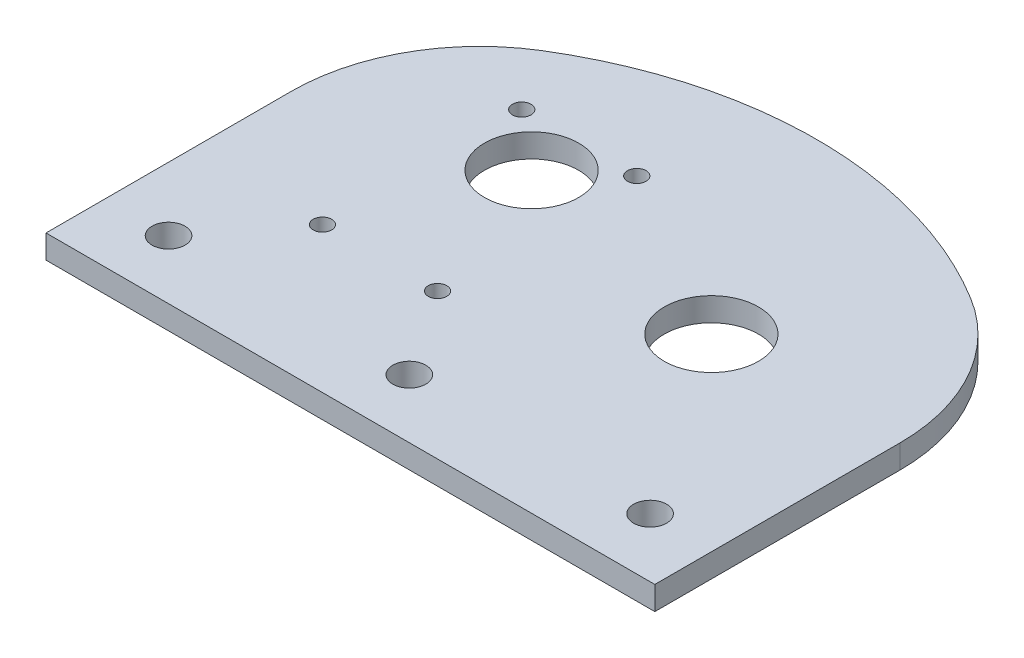
ISO-10303-21;
HEADER;
FILE_DESCRIPTION(('STEP AP214'),'2;1');
FILE_NAME('part.step','',(''),(''),'','','');
FILE_SCHEMA(('AUTOMOTIVE_DESIGN { 1 0 10303 214 1 1 1 1 }'));
ENDSEC;
DATA;
#1=APPLICATION_CONTEXT('core data for automotive mechanical design processes');
#2=APPLICATION_PROTOCOL_DEFINITION('international standard','automotive_design',2000,#1);
#3=PRODUCT_CONTEXT('',#1,'mechanical');
#4=PRODUCT('Part','Part','',(#3));
#5=PRODUCT_RELATED_PRODUCT_CATEGORY('part','',(#4));
#6=PRODUCT_DEFINITION_FORMATION('','',#4);
#7=PRODUCT_DEFINITION_CONTEXT('part definition',#1,'design');
#8=PRODUCT_DEFINITION('design','',#6,#7);
#9=PRODUCT_DEFINITION_SHAPE('','',#8);
#10=(LENGTH_UNIT() NAMED_UNIT(*) SI_UNIT(.MILLI.,.METRE.));
#11=(NAMED_UNIT(*) PLANE_ANGLE_UNIT() SI_UNIT($,.RADIAN.));
#12=(NAMED_UNIT(*) SI_UNIT($,.STERADIAN.) SOLID_ANGLE_UNIT());
#13=UNCERTAINTY_MEASURE_WITH_UNIT(LENGTH_MEASURE(1.E-05),#10,'distance_accuracy_value','');
#14=(GEOMETRIC_REPRESENTATION_CONTEXT(3) GLOBAL_UNCERTAINTY_ASSIGNED_CONTEXT((#13)) GLOBAL_UNIT_ASSIGNED_CONTEXT((#10,
#11,#12)) REPRESENTATION_CONTEXT('',''));
#15=CARTESIAN_POINT('',(0.,0.,0.));
#16=DIRECTION('',(0.,0.,1.));
#17=DIRECTION('',(1.,0.,0.));
#18=AXIS2_PLACEMENT_3D('',#15,#16,#17);
#19=CARTESIAN_POINT('',(0.,1.5875,0.));
#20=DIRECTION('',(0.,1.,0.));
#21=DIRECTION('',(0.,0.,1.));
#22=AXIS2_PLACEMENT_3D('',#19,#20,#21);
#23=PLANE('',#22);
#24=CARTESIAN_POINT('',(48.0524899919907,1.58750000000001,25.0825));
#25=DIRECTION('',(0.,-1.,0.));
#26=DIRECTION('',(0.,0.,-1.));
#27=AXIS2_PLACEMENT_3D('',#24,#25,#26);
#28=CIRCLE('',#27,2.2225);
#29=CARTESIAN_POINT('',(48.0524899919907,1.58750000000001,22.8599999999999));
#30=VERTEX_POINT('',#29);
#31=EDGE_CURVE('E265',#30,#30,#28,.T.);
#32=ORIENTED_EDGE('',*,*,#31,.T.);
#33=EDGE_LOOP('',(#32));
#34=FACE_BOUND('',#33,.T.);
#35=CARTESIAN_POINT('',(-16.8275,1.58750000000001,25.0825));
#36=DIRECTION('',(0.,-1.,0.));
#37=DIRECTION('',(0.,0.,-1.));
#38=AXIS2_PLACEMENT_3D('',#35,#36,#37);
#39=CIRCLE('',#38,2.2225);
#40=CARTESIAN_POINT('',(-16.8275,1.58750000000001,22.86));
#41=VERTEX_POINT('',#40);
#42=EDGE_CURVE('E268',#41,#41,#39,.T.);
#43=ORIENTED_EDGE('',*,*,#42,.T.);
#44=EDGE_LOOP('',(#43));
#45=FACE_BOUND('',#44,.T.);
#46=CARTESIAN_POINT('',(15.6124949959954,1.58750000000001,25.0825));
#47=DIRECTION('',(0.,-1.,0.));
#48=DIRECTION('',(0.,0.,-1.));
#49=AXIS2_PLACEMENT_3D('',#46,#47,#48);
#50=CIRCLE('',#49,2.2225);
#51=CARTESIAN_POINT('',(15.6124949959954,1.58750000000001,22.86));
#52=VERTEX_POINT('',#51);
#53=EDGE_CURVE('E109',#52,#52,#50,.T.);
#54=ORIENTED_EDGE('',*,*,#53,.T.);
#55=EDGE_LOOP('',(#54));
#56=FACE_BOUND('',#55,.T.);
#57=CARTESIAN_POINT('',(31.2249899919907,1.5875,0.));
#58=DIRECTION('',(0.,1.,0.));
#59=DIRECTION('',(0.,0.,1.));
#60=AXIS2_PLACEMENT_3D('',#57,#58,#59);
#61=CIRCLE('',#60,6.35000000002379);
#62=CARTESIAN_POINT('',(31.2249899919907,1.5875,6.35000000002379));
#63=VERTEX_POINT('',#62);
#64=EDGE_CURVE('E118',#63,#63,#61,.T.);
#65=ORIENTED_EDGE('',*,*,#64,.F.);
#66=EDGE_LOOP('',(#65));
#67=FACE_BOUND('',#66,.T.);
#68=CARTESIAN_POINT('',(15.612494995996,1.5875,25.4));
#69=DIRECTION('',(0.,1.,0.));
#70=DIRECTION('',(0.,0.,-1.));
#71=AXIS2_PLACEMENT_3D('',#68,#69,#70);
#72=CIRCLE('',#71,55.2145937419912);
#73=CARTESIAN_POINT('',(44.5257706878475,1.5875,-21.6390672830587));
#74=VERTEX_POINT('',#73);
#75=CARTESIAN_POINT('',(-13.3007806958569,1.5875,-21.6390672830582));
#76=VERTEX_POINT('',#75);
#77=EDGE_CURVE('E135',#74,#76,#72,.T.);
#78=ORIENTED_EDGE('',*,*,#77,.T.);
#79=CARTESIAN_POINT('',(0.,1.5875,0.));
#80=DIRECTION('',(0.,1.,0.));
#81=DIRECTION('',(0.,0.,1.));
#82=AXIS2_PLACEMENT_3D('',#79,#80,#81);
#83=CIRCLE('',#82,25.4);
#84=CARTESIAN_POINT('',(-25.4,1.5875,0.));
#85=VERTEX_POINT('',#84);
#86=EDGE_CURVE('E48',#76,#85,#83,.T.);
#87=ORIENTED_EDGE('',*,*,#86,.T.);
#88=DIRECTION('',(0.,0.,1.));
#89=VECTOR('',#88,1.);
#90=CARTESIAN_POINT('',(-25.4,1.5875,0.));
#91=LINE('',#90,#89);
#92=CARTESIAN_POINT('',(-25.4,1.58750000000001,33.02));
#93=VERTEX_POINT('',#92);
#94=EDGE_CURVE('E41',#85,#93,#91,.T.);
#95=ORIENTED_EDGE('',*,*,#94,.T.);
#96=DIRECTION('',(-1.,0.,0.));
#97=VECTOR('',#96,1.);
#98=CARTESIAN_POINT('',(56.6249899919907,1.5875,33.02));
#99=LINE('',#98,#97);
#100=CARTESIAN_POINT('',(56.6249899919907,1.5875,33.02));
#101=VERTEX_POINT('',#100);
#102=EDGE_CURVE('E108',#101,#93,#99,.T.);
#103=ORIENTED_EDGE('',*,*,#102,.F.);
#104=DIRECTION('',(0.,0.,-1.));
#105=VECTOR('',#104,1.);
#106=CARTESIAN_POINT('',(56.6249899919907,1.5875,25.4));
#107=LINE('',#106,#105);
#108=CARTESIAN_POINT('',(56.6249899919907,1.5875,0.));
#109=VERTEX_POINT('',#108);
#110=EDGE_CURVE('E131',#101,#109,#107,.T.);
#111=ORIENTED_EDGE('',*,*,#110,.T.);
#112=CARTESIAN_POINT('',(31.2249899919907,1.5875,0.));
#113=DIRECTION('',(0.,1.,0.));
#114=DIRECTION('',(0.,0.,1.));
#115=AXIS2_PLACEMENT_3D('',#112,#113,#114);
#116=CIRCLE('',#115,25.4);
#117=EDGE_CURVE('E133',#109,#74,#116,.T.);
#118=ORIENTED_EDGE('',*,*,#117,.T.);
#119=EDGE_LOOP('',(#78,#87,#95,#103,#111,#118));
#120=FACE_BOUND('',#119,.T.);
#121=CARTESIAN_POINT('',(-7.74999999999833,1.5875,13.4233937586596));
#122=DIRECTION('',(0.,1.,0.));
#123=DIRECTION('',(0.,0.,1.));
#124=AXIS2_PLACEMENT_3D('',#121,#122,#123);
#125=CIRCLE('',#124,1.24999999996294);
#126=CARTESIAN_POINT('',(-7.74999999999833,1.5875,14.6733937586226));
#127=VERTEX_POINT('',#126);
#128=EDGE_CURVE('E149',#127,#127,#125,.T.);
#129=ORIENTED_EDGE('',*,*,#128,.F.);
#130=EDGE_LOOP('',(#129));
#131=FACE_BOUND('',#130,.T.);
#132=CARTESIAN_POINT('',(7.74999999999825,1.5875,-13.4233937586599));
#133=DIRECTION('',(0.,1.,0.));
#134=DIRECTION('',(0.,0.,1.));
#135=AXIS2_PLACEMENT_3D('',#132,#133,#134);
#136=CIRCLE('',#135,1.25000000003696);
#137=CARTESIAN_POINT('',(7.74999999999825,1.5875,-12.173393758623));
#138=VERTEX_POINT('',#137);
#139=EDGE_CURVE('E161',#138,#138,#136,.T.);
#140=ORIENTED_EDGE('',*,*,#139,.F.);
#141=EDGE_LOOP('',(#140));
#142=FACE_BOUND('',#141,.T.);
#143=CARTESIAN_POINT('',(-9.40540621415415E-13,1.5875,-7.00000000000013));
#144=DIRECTION('',(0.,1.,0.));
#145=DIRECTION('',(0.,0.,1.));
#146=AXIS2_PLACEMENT_3D('',#143,#144,#145);
#147=CIRCLE('',#146,6.35000000002338);
#148=CARTESIAN_POINT('',(-9.40540621415415E-13,1.5875,-0.649999999976743));
#149=VERTEX_POINT('',#148);
#150=EDGE_CURVE('E167',#149,#149,#147,.T.);
#151=ORIENTED_EDGE('',*,*,#150,.F.);
#152=EDGE_LOOP('',(#151));
#153=FACE_BOUND('',#152,.T.);
#154=CARTESIAN_POINT('',(-7.75000000000178,1.5875,-13.4233937586579));
#155=DIRECTION('',(0.,1.,0.));
#156=DIRECTION('',(0.,0.,1.));
#157=AXIS2_PLACEMENT_3D('',#154,#155,#156);
#158=CIRCLE('',#157,1.25000000000191);
#159=CARTESIAN_POINT('',(-7.75000000000178,1.5875,-12.173393758656));
#160=VERTEX_POINT('',#159);
#161=EDGE_CURVE('E155',#160,#160,#158,.T.);
#162=ORIENTED_EDGE('',*,*,#161,.F.);
#163=EDGE_LOOP('',(#162));
#164=FACE_BOUND('',#163,.T.);
#165=CARTESIAN_POINT('',(7.7500000000017,1.5875,13.4233937586577));
#166=DIRECTION('',(0.,1.,0.));
#167=DIRECTION('',(0.,0.,1.));
#168=AXIS2_PLACEMENT_3D('',#165,#166,#167);
#169=CIRCLE('',#168,1.24999999994728);
#170=CARTESIAN_POINT('',(7.7500000000017,1.5875,14.673393758605));
#171=VERTEX_POINT('',#170);
#172=EDGE_CURVE('E143',#171,#171,#169,.T.);
#173=ORIENTED_EDGE('',*,*,#172,.F.);
#174=EDGE_LOOP('',(#173));
#175=FACE_BOUND('',#174,.T.);
#176=ADVANCED_FACE('F33',(#34,#45,#56,#67,#120,#131,#142,#153,#164,#175),#23,.T.);
#177=CARTESIAN_POINT('',(0.,-1.5875,0.));
#178=DIRECTION('',(0.,1.,0.));
#179=DIRECTION('',(0.,0.,1.));
#180=AXIS2_PLACEMENT_3D('',#177,#178,#179);
#181=PLANE('',#180);
#182=CARTESIAN_POINT('',(48.0524899919907,-1.5875,25.0825));
#183=DIRECTION('',(0.,-1.,0.));
#184=DIRECTION('',(0.,0.,-1.));
#185=AXIS2_PLACEMENT_3D('',#182,#183,#184);
#186=CIRCLE('',#185,2.2225);
#187=CARTESIAN_POINT('',(48.0524899919907,-1.5875,22.8599999999999));
#188=VERTEX_POINT('',#187);
#189=EDGE_CURVE('E267',#188,#188,#186,.T.);
#190=ORIENTED_EDGE('',*,*,#189,.F.);
#191=EDGE_LOOP('',(#190));
#192=FACE_BOUND('',#191,.T.);
#193=CARTESIAN_POINT('',(-16.8275,-1.5875,25.0825));
#194=DIRECTION('',(0.,-1.,0.));
#195=DIRECTION('',(0.,0.,-1.));
#196=AXIS2_PLACEMENT_3D('',#193,#194,#195);
#197=CIRCLE('',#196,2.2225);
#198=CARTESIAN_POINT('',(-16.8275,-1.5875,22.86));
#199=VERTEX_POINT('',#198);
#200=EDGE_CURVE('E272',#199,#199,#197,.T.);
#201=ORIENTED_EDGE('',*,*,#200,.F.);
#202=EDGE_LOOP('',(#201));
#203=FACE_BOUND('',#202,.T.);
#204=CARTESIAN_POINT('',(15.6124949959954,-1.5875,25.0825));
#205=DIRECTION('',(0.,-1.,0.));
#206=DIRECTION('',(0.,0.,-1.));
#207=AXIS2_PLACEMENT_3D('',#204,#205,#206);
#208=CIRCLE('',#207,2.2225);
#209=CARTESIAN_POINT('',(15.6124949959954,-1.5875,22.86));
#210=VERTEX_POINT('',#209);
#211=EDGE_CURVE('E112',#210,#210,#208,.T.);
#212=ORIENTED_EDGE('',*,*,#211,.F.);
#213=EDGE_LOOP('',(#212));
#214=FACE_BOUND('',#213,.T.);
#215=CARTESIAN_POINT('',(31.2249899919907,-1.5875,0.));
#216=DIRECTION('',(0.,1.,0.));
#217=DIRECTION('',(0.,0.,1.));
#218=AXIS2_PLACEMENT_3D('',#215,#216,#217);
#219=CIRCLE('',#218,6.35000000002379);
#220=CARTESIAN_POINT('',(31.2249899919907,-1.5875,6.35000000002379));
#221=VERTEX_POINT('',#220);
#222=EDGE_CURVE('E119',#221,#221,#219,.T.);
#223=ORIENTED_EDGE('',*,*,#222,.T.);
#224=EDGE_LOOP('',(#223));
#225=FACE_BOUND('',#224,.T.);
#226=CARTESIAN_POINT('',(0.,-1.5875,0.));
#227=DIRECTION('',(0.,1.,0.));
#228=DIRECTION('',(0.,0.,1.));
#229=AXIS2_PLACEMENT_3D('',#226,#227,#228);
#230=CIRCLE('',#229,25.4);
#231=CARTESIAN_POINT('',(-13.3007806958569,-1.5875,-21.6390672830582));
#232=VERTEX_POINT('',#231);
#233=CARTESIAN_POINT('',(-25.4,-1.5875,0.));
#234=VERTEX_POINT('',#233);
#235=EDGE_CURVE('E92',#232,#234,#230,.T.);
#236=ORIENTED_EDGE('',*,*,#235,.F.);
#237=CARTESIAN_POINT('',(15.612494995996,-1.5875,25.4));
#238=DIRECTION('',(0.,1.,0.));
#239=DIRECTION('',(0.,0.,-1.));
#240=AXIS2_PLACEMENT_3D('',#237,#238,#239);
#241=CIRCLE('',#240,55.2145937419912);
#242=CARTESIAN_POINT('',(44.5257706878475,-1.5875,-21.6390672830587));
#243=VERTEX_POINT('',#242);
#244=EDGE_CURVE('E128',#243,#232,#241,.T.);
#245=ORIENTED_EDGE('',*,*,#244,.F.);
#246=CARTESIAN_POINT('',(31.2249899919907,-1.5875,0.));
#247=DIRECTION('',(0.,1.,0.));
#248=DIRECTION('',(0.,0.,1.));
#249=AXIS2_PLACEMENT_3D('',#246,#247,#248);
#250=CIRCLE('',#249,25.4);
#251=CARTESIAN_POINT('',(56.6249899919907,-1.5875,0.));
#252=VERTEX_POINT('',#251);
#253=EDGE_CURVE('E125',#252,#243,#250,.T.);
#254=ORIENTED_EDGE('',*,*,#253,.F.);
#255=DIRECTION('',(0.,0.,-1.));
#256=VECTOR('',#255,1.);
#257=CARTESIAN_POINT('',(56.6249899919907,-1.5875,25.4));
#258=LINE('',#257,#256);
#259=CARTESIAN_POINT('',(56.6249899919907,-1.5875,33.02));
#260=VERTEX_POINT('',#259);
#261=EDGE_CURVE('E99',#260,#252,#258,.T.);
#262=ORIENTED_EDGE('',*,*,#261,.F.);
#263=DIRECTION('',(1.,0.,0.));
#264=VECTOR('',#263,1.);
#265=CARTESIAN_POINT('',(56.6249899919907,-1.5875,33.02));
#266=LINE('',#265,#264);
#267=CARTESIAN_POINT('',(-25.4,-1.58750000000001,33.02));
#268=VERTEX_POINT('',#267);
#269=EDGE_CURVE('E94',#268,#260,#266,.T.);
#270=ORIENTED_EDGE('',*,*,#269,.F.);
#271=DIRECTION('',(0.,0.,1.));
#272=VECTOR('',#271,1.);
#273=CARTESIAN_POINT('',(-25.4,-1.5875,0.));
#274=LINE('',#273,#272);
#275=EDGE_CURVE('E85',#234,#268,#274,.T.);
#276=ORIENTED_EDGE('',*,*,#275,.F.);
#277=EDGE_LOOP('',(#236,#245,#254,#262,#270,#276));
#278=FACE_BOUND('',#277,.T.);
#279=CARTESIAN_POINT('',(-9.40540621415415E-13,-1.5875,-7.00000000000013));
#280=DIRECTION('',(0.,1.,0.));
#281=DIRECTION('',(0.,0.,1.));
#282=AXIS2_PLACEMENT_3D('',#279,#280,#281);
#283=CIRCLE('',#282,6.35000000002338);
#284=CARTESIAN_POINT('',(-9.40540621415415E-13,-1.5875,-0.649999999976743));
#285=VERTEX_POINT('',#284);
#286=EDGE_CURVE('E164',#285,#285,#283,.T.);
#287=ORIENTED_EDGE('',*,*,#286,.T.);
#288=EDGE_LOOP('',(#287));
#289=FACE_BOUND('',#288,.T.);
#290=CARTESIAN_POINT('',(7.74999999999825,-1.5875,-13.4233937586599));
#291=DIRECTION('',(0.,1.,0.));
#292=DIRECTION('',(0.,0.,1.));
#293=AXIS2_PLACEMENT_3D('',#290,#291,#292);
#294=CIRCLE('',#293,1.25000000003696);
#295=CARTESIAN_POINT('',(7.74999999999825,-1.5875,-12.173393758623));
#296=VERTEX_POINT('',#295);
#297=EDGE_CURVE('E158',#296,#296,#294,.T.);
#298=ORIENTED_EDGE('',*,*,#297,.T.);
#299=EDGE_LOOP('',(#298));
#300=FACE_BOUND('',#299,.T.);
#301=CARTESIAN_POINT('',(-7.75000000000178,-1.5875,-13.4233937586579));
#302=DIRECTION('',(0.,1.,0.));
#303=DIRECTION('',(0.,0.,1.));
#304=AXIS2_PLACEMENT_3D('',#301,#302,#303);
#305=CIRCLE('',#304,1.25000000000191);
#306=CARTESIAN_POINT('',(-7.75000000000178,-1.5875,-12.173393758656));
#307=VERTEX_POINT('',#306);
#308=EDGE_CURVE('E152',#307,#307,#305,.T.);
#309=ORIENTED_EDGE('',*,*,#308,.T.);
#310=EDGE_LOOP('',(#309));
#311=FACE_BOUND('',#310,.T.);
#312=CARTESIAN_POINT('',(-7.74999999999833,-1.5875,13.4233937586596));
#313=DIRECTION('',(0.,1.,0.));
#314=DIRECTION('',(0.,0.,1.));
#315=AXIS2_PLACEMENT_3D('',#312,#313,#314);
#316=CIRCLE('',#315,1.24999999996294);
#317=CARTESIAN_POINT('',(-7.74999999999833,-1.5875,14.6733937586226));
#318=VERTEX_POINT('',#317);
#319=EDGE_CURVE('E146',#318,#318,#316,.T.);
#320=ORIENTED_EDGE('',*,*,#319,.T.);
#321=EDGE_LOOP('',(#320));
#322=FACE_BOUND('',#321,.T.);
#323=CARTESIAN_POINT('',(7.7500000000017,-1.5875,13.4233937586577));
#324=DIRECTION('',(0.,1.,0.));
#325=DIRECTION('',(0.,0.,1.));
#326=AXIS2_PLACEMENT_3D('',#323,#324,#325);
#327=CIRCLE('',#326,1.24999999994728);
#328=CARTESIAN_POINT('',(7.7500000000017,-1.5875,14.673393758605));
#329=VERTEX_POINT('',#328);
#330=EDGE_CURVE('E142',#329,#329,#327,.T.);
#331=ORIENTED_EDGE('',*,*,#330,.T.);
#332=EDGE_LOOP('',(#331));
#333=FACE_BOUND('',#332,.T.);
#334=ADVANCED_FACE('F95',(#192,#203,#214,#225,#278,#289,#300,#311,#322,#333),#181,.F.);
#335=CARTESIAN_POINT('',(0.,1.5875,0.));
#336=DIRECTION('',(0.,-1.,0.));
#337=DIRECTION('',(0.,0.,-1.));
#338=AXIS2_PLACEMENT_3D('',#335,#336,#337);
#339=CYLINDRICAL_SURFACE('',#338,25.4);
#340=ORIENTED_EDGE('',*,*,#86,.F.);
#341=DIRECTION('',(0.,-1.,0.));
#342=VECTOR('',#341,1.);
#343=CARTESIAN_POINT('',(-13.3007806958568,1.5875,-21.6390672830579));
#344=LINE('',#343,#342);
#345=EDGE_CURVE('E53',#76,#232,#344,.T.);
#346=ORIENTED_EDGE('',*,*,#345,.T.);
#347=ORIENTED_EDGE('',*,*,#235,.T.);
#348=DIRECTION('',(0.,-1.,0.));
#349=VECTOR('',#348,1.);
#350=CARTESIAN_POINT('',(-25.4,1.5875,0.));
#351=LINE('',#350,#349);
#352=EDGE_CURVE('E11',#85,#234,#351,.T.);
#353=ORIENTED_EDGE('',*,*,#352,.F.);
#354=EDGE_LOOP('',(#340,#346,#347,#353));
#355=FACE_BOUND('',#354,.T.);
#356=ADVANCED_FACE('F35',(#355),#339,.T.);
#357=CARTESIAN_POINT('',(-25.4,1.5875,0.));
#358=DIRECTION('',(1.,0.,0.));
#359=DIRECTION('',(0.,0.,-1.));
#360=AXIS2_PLACEMENT_3D('',#357,#358,#359);
#361=PLANE('',#360);
#362=ORIENTED_EDGE('',*,*,#275,.T.);
#363=DIRECTION('',(0.,-1.,0.));
#364=VECTOR('',#363,1.);
#365=CARTESIAN_POINT('',(-25.4,1.58750000000001,33.02));
#366=LINE('',#365,#364);
#367=EDGE_CURVE('E90',#93,#268,#366,.T.);
#368=ORIENTED_EDGE('',*,*,#367,.F.);
#369=ORIENTED_EDGE('',*,*,#94,.F.);
#370=ORIENTED_EDGE('',*,*,#352,.T.);
#371=EDGE_LOOP('',(#362,#368,#369,#370));
#372=FACE_BOUND('',#371,.T.);
#373=ADVANCED_FACE('F87',(#372),#361,.F.);
#374=CARTESIAN_POINT('',(-9.40540621415415E-13,1.5875,-7.00000000000013));
#375=DIRECTION('',(0.,-1.,0.));
#376=DIRECTION('',(0.,0.,-1.));
#377=AXIS2_PLACEMENT_3D('',#374,#375,#376);
#378=CYLINDRICAL_SURFACE('',#377,6.35000000002338);
#379=ORIENTED_EDGE('',*,*,#150,.T.);
#380=EDGE_LOOP('',(#379));
#381=FACE_BOUND('',#380,.T.);
#382=ORIENTED_EDGE('',*,*,#286,.F.);
#383=EDGE_LOOP('',(#382));
#384=FACE_BOUND('',#383,.T.);
#385=ADVANCED_FACE('F217',(#381,#384),#378,.F.);
#386=CARTESIAN_POINT('',(7.74999999999825,1.5875,-13.4233937586599));
#387=DIRECTION('',(0.,-1.,0.));
#388=DIRECTION('',(0.,0.,-1.));
#389=AXIS2_PLACEMENT_3D('',#386,#387,#388);
#390=CYLINDRICAL_SURFACE('',#389,1.25000000003696);
#391=ORIENTED_EDGE('',*,*,#139,.T.);
#392=EDGE_LOOP('',(#391));
#393=FACE_BOUND('',#392,.T.);
#394=ORIENTED_EDGE('',*,*,#297,.F.);
#395=EDGE_LOOP('',(#394));
#396=FACE_BOUND('',#395,.T.);
#397=ADVANCED_FACE('F221',(#393,#396),#390,.F.);
#398=CARTESIAN_POINT('',(-7.75000000000178,1.5875,-13.4233937586579));
#399=DIRECTION('',(0.,-1.,0.));
#400=DIRECTION('',(0.,0.,-1.));
#401=AXIS2_PLACEMENT_3D('',#398,#399,#400);
#402=CYLINDRICAL_SURFACE('',#401,1.25000000000191);
#403=ORIENTED_EDGE('',*,*,#161,.T.);
#404=EDGE_LOOP('',(#403));
#405=FACE_BOUND('',#404,.T.);
#406=ORIENTED_EDGE('',*,*,#308,.F.);
#407=EDGE_LOOP('',(#406));
#408=FACE_BOUND('',#407,.T.);
#409=ADVANCED_FACE('F226',(#405,#408),#402,.F.);
#410=CARTESIAN_POINT('',(-7.74999999999833,1.5875,13.4233937586596));
#411=DIRECTION('',(0.,-1.,0.));
#412=DIRECTION('',(0.,0.,-1.));
#413=AXIS2_PLACEMENT_3D('',#410,#411,#412);
#414=CYLINDRICAL_SURFACE('',#413,1.24999999996294);
#415=ORIENTED_EDGE('',*,*,#128,.T.);
#416=EDGE_LOOP('',(#415));
#417=FACE_BOUND('',#416,.T.);
#418=ORIENTED_EDGE('',*,*,#319,.F.);
#419=EDGE_LOOP('',(#418));
#420=FACE_BOUND('',#419,.T.);
#421=ADVANCED_FACE('F203',(#417,#420),#414,.F.);
#422=CARTESIAN_POINT('',(7.7500000000017,1.5875,13.4233937586577));
#423=DIRECTION('',(0.,-1.,0.));
#424=DIRECTION('',(0.,0.,-1.));
#425=AXIS2_PLACEMENT_3D('',#422,#423,#424);
#426=CYLINDRICAL_SURFACE('',#425,1.24999999994728);
#427=ORIENTED_EDGE('',*,*,#172,.T.);
#428=EDGE_LOOP('',(#427));
#429=FACE_BOUND('',#428,.T.);
#430=ORIENTED_EDGE('',*,*,#330,.F.);
#431=EDGE_LOOP('',(#430));
#432=FACE_BOUND('',#431,.T.);
#433=ADVANCED_FACE('F200',(#429,#432),#426,.F.);
#434=CARTESIAN_POINT('',(56.6249899919907,1.5875,25.4));
#435=DIRECTION('',(-1.,0.,0.));
#436=DIRECTION('',(0.,0.,1.));
#437=AXIS2_PLACEMENT_3D('',#434,#435,#436);
#438=PLANE('',#437);
#439=ORIENTED_EDGE('',*,*,#110,.F.);
#440=DIRECTION('',(0.,1.,0.));
#441=VECTOR('',#440,1.);
#442=CARTESIAN_POINT('',(56.6249899919907,1.5875,33.02));
#443=LINE('',#442,#441);
#444=EDGE_CURVE('E103',#260,#101,#443,.T.);
#445=ORIENTED_EDGE('',*,*,#444,.F.);
#446=ORIENTED_EDGE('',*,*,#261,.T.);
#447=DIRECTION('',(0.,-1.,0.));
#448=VECTOR('',#447,1.);
#449=CARTESIAN_POINT('',(56.6249899919907,1.5875,0.));
#450=LINE('',#449,#448);
#451=EDGE_CURVE('E140',#109,#252,#450,.T.);
#452=ORIENTED_EDGE('',*,*,#451,.F.);
#453=EDGE_LOOP('',(#439,#445,#446,#452));
#454=FACE_BOUND('',#453,.T.);
#455=ADVANCED_FACE('F184',(#454),#438,.F.);
#456=CARTESIAN_POINT('',(31.2249899919907,1.5875,0.));
#457=DIRECTION('',(0.,-1.,0.));
#458=DIRECTION('',(0.,0.,-1.));
#459=AXIS2_PLACEMENT_3D('',#456,#457,#458);
#460=CYLINDRICAL_SURFACE('',#459,25.4);
#461=ORIENTED_EDGE('',*,*,#451,.T.);
#462=ORIENTED_EDGE('',*,*,#253,.T.);
#463=DIRECTION('',(0.,-1.,0.));
#464=VECTOR('',#463,1.);
#465=CARTESIAN_POINT('',(44.5257706878475,1.5875,-21.6390672830587));
#466=LINE('',#465,#464);
#467=EDGE_CURVE('E138',#74,#243,#466,.T.);
#468=ORIENTED_EDGE('',*,*,#467,.F.);
#469=ORIENTED_EDGE('',*,*,#117,.F.);
#470=EDGE_LOOP('',(#461,#462,#468,#469));
#471=FACE_BOUND('',#470,.T.);
#472=ADVANCED_FACE('F181',(#471),#460,.T.);
#473=CARTESIAN_POINT('',(15.612494995996,1.5875,25.4));
#474=DIRECTION('',(0.,-1.,0.));
#475=DIRECTION('',(0.,0.,-1.));
#476=AXIS2_PLACEMENT_3D('',#473,#474,#475);
#477=CYLINDRICAL_SURFACE('',#476,55.2145937419912);
#478=ORIENTED_EDGE('',*,*,#467,.T.);
#479=ORIENTED_EDGE('',*,*,#244,.T.);
#480=ORIENTED_EDGE('',*,*,#345,.F.);
#481=ORIENTED_EDGE('',*,*,#77,.F.);
#482=EDGE_LOOP('',(#478,#479,#480,#481));
#483=FACE_BOUND('',#482,.T.);
#484=ADVANCED_FACE('F176',(#483),#477,.T.);
#485=CARTESIAN_POINT('',(31.2249899919907,-1.5875,0.));
#486=DIRECTION('',(0.,1.,0.));
#487=DIRECTION('',(0.,0.,1.));
#488=AXIS2_PLACEMENT_3D('',#485,#486,#487);
#489=CYLINDRICAL_SURFACE('',#488,6.35000000002379);
#490=ORIENTED_EDGE('',*,*,#222,.F.);
#491=EDGE_LOOP('',(#490));
#492=FACE_BOUND('',#491,.T.);
#493=ORIENTED_EDGE('',*,*,#64,.T.);
#494=EDGE_LOOP('',(#493));
#495=FACE_BOUND('',#494,.T.);
#496=ADVANCED_FACE('F243',(#492,#495),#489,.F.);
#497=CARTESIAN_POINT('',(0.,0.,33.02));
#498=DIRECTION('',(0.,0.,-1.));
#499=DIRECTION('',(-1.,0.,0.));
#500=AXIS2_PLACEMENT_3D('',#497,#498,#499);
#501=PLANE('',#500);
#502=ORIENTED_EDGE('',*,*,#367,.T.);
#503=ORIENTED_EDGE('',*,*,#269,.T.);
#504=ORIENTED_EDGE('',*,*,#444,.T.);
#505=ORIENTED_EDGE('',*,*,#102,.T.);
#506=EDGE_LOOP('',(#502,#503,#504,#505));
#507=FACE_BOUND('',#506,.T.);
#508=ADVANCED_FACE('F106',(#507),#501,.F.);
#509=CARTESIAN_POINT('',(15.6124949959954,1.58750000000001,25.0825));
#510=DIRECTION('',(0.,-1.,0.));
#511=DIRECTION('',(0.,0.,-1.));
#512=AXIS2_PLACEMENT_3D('',#509,#510,#511);
#513=CYLINDRICAL_SURFACE('',#512,2.2225);
#514=ORIENTED_EDGE('',*,*,#53,.F.);
#515=EDGE_LOOP('',(#514));
#516=FACE_BOUND('',#515,.T.);
#517=ORIENTED_EDGE('',*,*,#211,.T.);
#518=EDGE_LOOP('',(#517));
#519=FACE_BOUND('',#518,.T.);
#520=ADVANCED_FACE('F249',(#516,#519),#513,.F.);
#521=CARTESIAN_POINT('',(-16.8275,1.58750000000001,25.0825));
#522=DIRECTION('',(0.,-1.,0.));
#523=DIRECTION('',(0.,0.,-1.));
#524=AXIS2_PLACEMENT_3D('',#521,#522,#523);
#525=CYLINDRICAL_SURFACE('',#524,2.2225);
#526=ORIENTED_EDGE('',*,*,#42,.F.);
#527=EDGE_LOOP('',(#526));
#528=FACE_BOUND('',#527,.T.);
#529=ORIENTED_EDGE('',*,*,#200,.T.);
#530=EDGE_LOOP('',(#529));
#531=FACE_BOUND('',#530,.T.);
#532=ADVANCED_FACE('F252',(#528,#531),#525,.F.);
#533=CARTESIAN_POINT('',(48.0524899919907,1.58750000000001,25.0825));
#534=DIRECTION('',(0.,-1.,0.));
#535=DIRECTION('',(0.,0.,-1.));
#536=AXIS2_PLACEMENT_3D('',#533,#534,#535);
#537=CYLINDRICAL_SURFACE('',#536,2.2225);
#538=ORIENTED_EDGE('',*,*,#31,.F.);
#539=EDGE_LOOP('',(#538));
#540=FACE_BOUND('',#539,.T.);
#541=ORIENTED_EDGE('',*,*,#189,.T.);
#542=EDGE_LOOP('',(#541));
#543=FACE_BOUND('',#542,.T.);
#544=ADVANCED_FACE('F256',(#540,#543),#537,.F.);
#545=CLOSED_SHELL('',(#176,#334,#356,#373,#385,#397,#409,#421,#433,#455,#472,#484,#496,#508,
#520,#532,#544));
#546=MANIFOLD_SOLID_BREP('B2',#545);
#547=ADVANCED_BREP_SHAPE_REPRESENTATION('',(#18,#546),#14);
#548=SHAPE_DEFINITION_REPRESENTATION(#9,#547);
ENDSEC;
END-ISO-10303-21;
